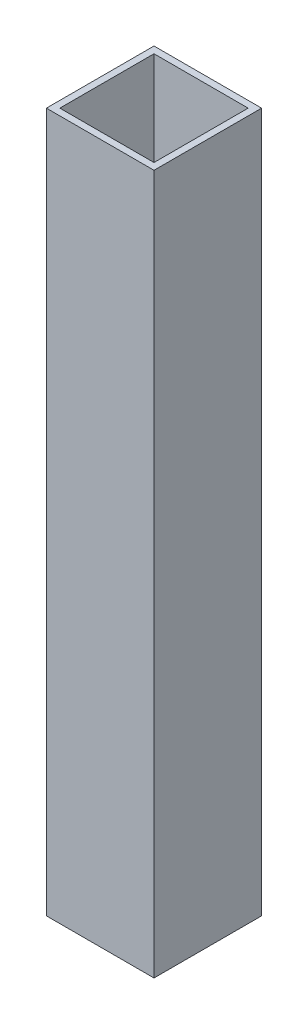
ISO-10303-21;
HEADER;
FILE_DESCRIPTION(('STEP AP214'),'2;1');
FILE_NAME('part.step','',(''),(''),'','','');
FILE_SCHEMA(('AUTOMOTIVE_DESIGN { 1 0 10303 214 1 1 1 1 }'));
ENDSEC;
DATA;
#1=APPLICATION_CONTEXT('core data for automotive mechanical design processes');
#2=APPLICATION_PROTOCOL_DEFINITION('international standard','automotive_design',2000,#1);
#3=PRODUCT_CONTEXT('',#1,'mechanical');
#4=PRODUCT('Part','Part','',(#3));
#5=PRODUCT_RELATED_PRODUCT_CATEGORY('part','',(#4));
#6=PRODUCT_DEFINITION_FORMATION('','',#4);
#7=PRODUCT_DEFINITION_CONTEXT('part definition',#1,'design');
#8=PRODUCT_DEFINITION('design','',#6,#7);
#9=PRODUCT_DEFINITION_SHAPE('','',#8);
#10=(LENGTH_UNIT() NAMED_UNIT(*) SI_UNIT(.MILLI.,.METRE.));
#11=(NAMED_UNIT(*) PLANE_ANGLE_UNIT() SI_UNIT($,.RADIAN.));
#12=(NAMED_UNIT(*) SI_UNIT($,.STERADIAN.) SOLID_ANGLE_UNIT());
#13=UNCERTAINTY_MEASURE_WITH_UNIT(LENGTH_MEASURE(1.E-05),#10,'distance_accuracy_value','');
#14=(GEOMETRIC_REPRESENTATION_CONTEXT(3) GLOBAL_UNCERTAINTY_ASSIGNED_CONTEXT((#13)) GLOBAL_UNIT_ASSIGNED_CONTEXT((#10,
#11,#12)) REPRESENTATION_CONTEXT('',''));
#15=CARTESIAN_POINT('',(0.,0.,0.));
#16=DIRECTION('',(0.,0.,1.));
#17=DIRECTION('',(1.,0.,0.));
#18=AXIS2_PLACEMENT_3D('',#15,#16,#17);
#19=CARTESIAN_POINT('',(821.935699023182,165.1,152.4));
#20=DIRECTION('',(1.,0.,0.));
#21=DIRECTION('',(0.,0.,-1.));
#22=AXIS2_PLACEMENT_3D('',#19,#20,#21);
#23=PLANE('',#22);
#24=DIRECTION('',(0.,0.,1.));
#25=VECTOR('',#24,1.);
#26=CARTESIAN_POINT('',(821.935699023182,-165.1,152.4));
#27=LINE('',#26,#25);
#28=CARTESIAN_POINT('',(821.935699023182,-165.1,130.175));
#29=VERTEX_POINT('',#28);
#30=CARTESIAN_POINT('',(821.935699023182,-165.1,174.625));
#31=VERTEX_POINT('',#30);
#32=EDGE_CURVE('E158',#29,#31,#27,.T.);
#33=ORIENTED_EDGE('',*,*,#32,.T.);
#34=DIRECTION('',(0.,-1.,0.));
#35=VECTOR('',#34,1.);
#36=CARTESIAN_POINT('',(821.935699023182,165.1,174.625));
#37=LINE('',#36,#35);
#38=CARTESIAN_POINT('',(821.935699023182,165.1,174.625));
#39=VERTEX_POINT('',#38);
#40=EDGE_CURVE('E11',#39,#31,#37,.T.);
#41=ORIENTED_EDGE('',*,*,#40,.F.);
#42=DIRECTION('',(0.,0.,1.));
#43=VECTOR('',#42,1.);
#44=CARTESIAN_POINT('',(821.935699023182,165.1,152.4));
#45=LINE('',#44,#43);
#46=CARTESIAN_POINT('',(821.935699023182,165.1,130.175));
#47=VERTEX_POINT('',#46);
#48=EDGE_CURVE('E118',#47,#39,#45,.T.);
#49=ORIENTED_EDGE('',*,*,#48,.F.);
#50=DIRECTION('',(0.,-1.,0.));
#51=VECTOR('',#50,1.);
#52=CARTESIAN_POINT('',(821.935699023182,165.1,130.175));
#53=LINE('',#52,#51);
#54=EDGE_CURVE('E41',#47,#29,#53,.T.);
#55=ORIENTED_EDGE('',*,*,#54,.T.);
#56=EDGE_LOOP('',(#33,#41,#49,#55));
#57=FACE_BOUND('',#56,.T.);
#58=ADVANCED_FACE('F16',(#57),#23,.F.);
#59=CARTESIAN_POINT('',(822.268575429916,165.1,174.625));
#60=DIRECTION('',(0.,0.,1.));
#61=DIRECTION('',(1.,0.,0.));
#62=AXIS2_PLACEMENT_3D('',#59,#60,#61);
#63=PLANE('',#62);
#64=DIRECTION('',(-1.,0.,0.));
#65=VECTOR('',#64,1.);
#66=CARTESIAN_POINT('',(822.268575429916,-165.1,174.625));
#67=LINE('',#66,#65);
#68=CARTESIAN_POINT('',(777.485699023182,-165.1,174.625));
#69=VERTEX_POINT('',#68);
#70=EDGE_CURVE('E125',#31,#69,#67,.T.);
#71=ORIENTED_EDGE('',*,*,#70,.T.);
#72=DIRECTION('',(0.,-1.,0.));
#73=VECTOR('',#72,1.);
#74=CARTESIAN_POINT('',(777.485699023182,165.1,174.625));
#75=LINE('',#74,#73);
#76=CARTESIAN_POINT('',(777.485699023182,165.1,174.625));
#77=VERTEX_POINT('',#76);
#78=EDGE_CURVE('E27',#77,#69,#75,.T.);
#79=ORIENTED_EDGE('',*,*,#78,.F.);
#80=DIRECTION('',(-1.,0.,0.));
#81=VECTOR('',#80,1.);
#82=CARTESIAN_POINT('',(822.268575429916,165.1,174.625));
#83=LINE('',#82,#81);
#84=EDGE_CURVE('E112',#39,#77,#83,.T.);
#85=ORIENTED_EDGE('',*,*,#84,.F.);
#86=ORIENTED_EDGE('',*,*,#40,.T.);
#87=EDGE_LOOP('',(#71,#79,#85,#86));
#88=FACE_BOUND('',#87,.T.);
#89=ADVANCED_FACE('F124',(#88),#63,.F.);
#90=CARTESIAN_POINT('',(777.485699023182,165.1,152.4));
#91=DIRECTION('',(1.,0.,0.));
#92=DIRECTION('',(0.,0.,-1.));
#93=AXIS2_PLACEMENT_3D('',#90,#91,#92);
#94=PLANE('',#93);
#95=DIRECTION('',(0.,0.,1.));
#96=VECTOR('',#95,1.);
#97=CARTESIAN_POINT('',(777.485699023182,-165.1,152.4));
#98=LINE('',#97,#96);
#99=CARTESIAN_POINT('',(777.485699023182,-165.1,130.175));
#100=VERTEX_POINT('',#99);
#101=EDGE_CURVE('E163',#100,#69,#98,.T.);
#102=ORIENTED_EDGE('',*,*,#101,.F.);
#103=DIRECTION('',(0.,-1.,0.));
#104=VECTOR('',#103,1.);
#105=CARTESIAN_POINT('',(777.485699023182,165.1,130.175));
#106=LINE('',#105,#104);
#107=CARTESIAN_POINT('',(777.485699023182,165.1,130.175));
#108=VERTEX_POINT('',#107);
#109=EDGE_CURVE('E76',#108,#100,#106,.T.);
#110=ORIENTED_EDGE('',*,*,#109,.F.);
#111=DIRECTION('',(0.,0.,1.));
#112=VECTOR('',#111,1.);
#113=CARTESIAN_POINT('',(777.485699023182,165.1,152.4));
#114=LINE('',#113,#112);
#115=EDGE_CURVE('E117',#108,#77,#114,.T.);
#116=ORIENTED_EDGE('',*,*,#115,.T.);
#117=ORIENTED_EDGE('',*,*,#78,.T.);
#118=EDGE_LOOP('',(#102,#110,#116,#117));
#119=FACE_BOUND('',#118,.T.);
#120=ADVANCED_FACE('F130',(#119),#94,.T.);
#121=CARTESIAN_POINT('',(661.181740408425,165.1,127.));
#122=DIRECTION('',(0.,0.,-1.));
#123=DIRECTION('',(-1.,0.,0.));
#124=AXIS2_PLACEMENT_3D('',#121,#122,#123);
#125=PLANE('',#124);
#126=DIRECTION('',(1.,0.,0.));
#127=VECTOR('',#126,1.);
#128=CARTESIAN_POINT('',(661.181740408425,-165.1,127.));
#129=LINE('',#128,#127);
#130=CARTESIAN_POINT('',(774.310699023182,-165.1,127.));
#131=VERTEX_POINT('',#130);
#132=CARTESIAN_POINT('',(825.110699023182,-165.1,127.));
#133=VERTEX_POINT('',#132);
#134=EDGE_CURVE('E142',#131,#133,#129,.T.);
#135=ORIENTED_EDGE('',*,*,#134,.F.);
#136=DIRECTION('',(0.,-1.,0.));
#137=VECTOR('',#136,1.);
#138=CARTESIAN_POINT('',(774.310699023182,165.1,127.));
#139=LINE('',#138,#137);
#140=CARTESIAN_POINT('',(774.310699023182,165.1,127.));
#141=VERTEX_POINT('',#140);
#142=EDGE_CURVE('E20',#141,#131,#139,.T.);
#143=ORIENTED_EDGE('',*,*,#142,.F.);
#144=DIRECTION('',(1.,0.,0.));
#145=VECTOR('',#144,1.);
#146=CARTESIAN_POINT('',(661.181740408425,165.1,127.));
#147=LINE('',#146,#145);
#148=CARTESIAN_POINT('',(825.110699023182,165.1,127.));
#149=VERTEX_POINT('',#148);
#150=EDGE_CURVE('E170',#141,#149,#147,.T.);
#151=ORIENTED_EDGE('',*,*,#150,.T.);
#152=DIRECTION('',(0.,-1.,0.));
#153=VECTOR('',#152,1.);
#154=CARTESIAN_POINT('',(825.110699023182,165.1,127.));
#155=LINE('',#154,#153);
#156=EDGE_CURVE('E138',#149,#133,#155,.T.);
#157=ORIENTED_EDGE('',*,*,#156,.T.);
#158=EDGE_LOOP('',(#135,#143,#151,#157));
#159=FACE_BOUND('',#158,.T.);
#160=ADVANCED_FACE('F18',(#159),#125,.T.);
#161=CARTESIAN_POINT('',(774.310699023182,165.1,152.4));
#162=DIRECTION('',(1.,0.,0.));
#163=DIRECTION('',(0.,0.,-1.));
#164=AXIS2_PLACEMENT_3D('',#161,#162,#163);
#165=PLANE('',#164);
#166=DIRECTION('',(0.,0.,1.));
#167=VECTOR('',#166,1.);
#168=CARTESIAN_POINT('',(774.310699023182,-165.1,152.4));
#169=LINE('',#168,#167);
#170=CARTESIAN_POINT('',(774.310699023182,-165.1,177.8));
#171=VERTEX_POINT('',#170);
#172=EDGE_CURVE('E146',#131,#171,#169,.T.);
#173=ORIENTED_EDGE('',*,*,#172,.T.);
#174=DIRECTION('',(0.,-1.,0.));
#175=VECTOR('',#174,1.);
#176=CARTESIAN_POINT('',(774.310699023182,165.1,177.8));
#177=LINE('',#176,#175);
#178=CARTESIAN_POINT('',(774.310699023182,165.1,177.8));
#179=VERTEX_POINT('',#178);
#180=EDGE_CURVE('E179',#179,#171,#177,.T.);
#181=ORIENTED_EDGE('',*,*,#180,.F.);
#182=DIRECTION('',(0.,0.,1.));
#183=VECTOR('',#182,1.);
#184=CARTESIAN_POINT('',(774.310699023182,165.1,152.4));
#185=LINE('',#184,#183);
#186=EDGE_CURVE('E191',#141,#179,#185,.T.);
#187=ORIENTED_EDGE('',*,*,#186,.F.);
#188=ORIENTED_EDGE('',*,*,#142,.T.);
#189=EDGE_LOOP('',(#173,#181,#187,#188));
#190=FACE_BOUND('',#189,.T.);
#191=ADVANCED_FACE('F190',(#190),#165,.F.);
#192=CARTESIAN_POINT('',(686.616627278044,165.1,177.8));
#193=DIRECTION('',(0.,0.,1.));
#194=DIRECTION('',(1.,0.,0.));
#195=AXIS2_PLACEMENT_3D('',#192,#193,#194);
#196=PLANE('',#195);
#197=DIRECTION('',(-1.,0.,0.));
#198=VECTOR('',#197,1.);
#199=CARTESIAN_POINT('',(686.616627278044,-165.1,177.8));
#200=LINE('',#199,#198);
#201=CARTESIAN_POINT('',(825.110699023182,-165.1,177.8));
#202=VERTEX_POINT('',#201);
#203=EDGE_CURVE('E150',#202,#171,#200,.T.);
#204=ORIENTED_EDGE('',*,*,#203,.F.);
#205=DIRECTION('',(0.,-1.,0.));
#206=VECTOR('',#205,1.);
#207=CARTESIAN_POINT('',(825.110699023182,165.1,177.8));
#208=LINE('',#207,#206);
#209=CARTESIAN_POINT('',(825.110699023182,165.1,177.8));
#210=VERTEX_POINT('',#209);
#211=EDGE_CURVE('E177',#210,#202,#208,.T.);
#212=ORIENTED_EDGE('',*,*,#211,.F.);
#213=DIRECTION('',(-1.,0.,0.));
#214=VECTOR('',#213,1.);
#215=CARTESIAN_POINT('',(686.616627278044,165.1,177.8));
#216=LINE('',#215,#214);
#217=EDGE_CURVE('E234',#210,#179,#216,.T.);
#218=ORIENTED_EDGE('',*,*,#217,.T.);
#219=ORIENTED_EDGE('',*,*,#180,.T.);
#220=EDGE_LOOP('',(#204,#212,#218,#219));
#221=FACE_BOUND('',#220,.T.);
#222=ADVANCED_FACE('F203',(#221),#196,.T.);
#223=CARTESIAN_POINT('',(825.110699023182,165.1,152.4));
#224=DIRECTION('',(1.,0.,0.));
#225=DIRECTION('',(0.,0.,-1.));
#226=AXIS2_PLACEMENT_3D('',#223,#224,#225);
#227=PLANE('',#226);
#228=DIRECTION('',(0.,0.,1.));
#229=VECTOR('',#228,1.);
#230=CARTESIAN_POINT('',(825.110699023182,-165.1,152.4));
#231=LINE('',#230,#229);
#232=EDGE_CURVE('E154',#133,#202,#231,.T.);
#233=ORIENTED_EDGE('',*,*,#232,.F.);
#234=ORIENTED_EDGE('',*,*,#156,.F.);
#235=DIRECTION('',(0.,0.,1.));
#236=VECTOR('',#235,1.);
#237=CARTESIAN_POINT('',(825.110699023182,165.1,152.4));
#238=LINE('',#237,#236);
#239=EDGE_CURVE('E201',#149,#210,#238,.T.);
#240=ORIENTED_EDGE('',*,*,#239,.T.);
#241=ORIENTED_EDGE('',*,*,#211,.T.);
#242=EDGE_LOOP('',(#233,#234,#240,#241));
#243=FACE_BOUND('',#242,.T.);
#244=ADVANCED_FACE('F200',(#243),#227,.T.);
#245=CARTESIAN_POINT('',(822.268575429916,165.1,130.175));
#246=DIRECTION('',(0.,0.,1.));
#247=DIRECTION('',(1.,0.,0.));
#248=AXIS2_PLACEMENT_3D('',#245,#246,#247);
#249=PLANE('',#248);
#250=DIRECTION('',(-1.,0.,0.));
#251=VECTOR('',#250,1.);
#252=CARTESIAN_POINT('',(822.268575429916,-165.1,130.175));
#253=LINE('',#252,#251);
#254=EDGE_CURVE('E166',#29,#100,#253,.T.);
#255=ORIENTED_EDGE('',*,*,#254,.F.);
#256=ORIENTED_EDGE('',*,*,#54,.F.);
#257=DIRECTION('',(-1.,0.,0.));
#258=VECTOR('',#257,1.);
#259=CARTESIAN_POINT('',(822.268575429916,165.1,130.175));
#260=LINE('',#259,#258);
#261=EDGE_CURVE('E132',#47,#108,#260,.T.);
#262=ORIENTED_EDGE('',*,*,#261,.T.);
#263=ORIENTED_EDGE('',*,*,#109,.T.);
#264=EDGE_LOOP('',(#255,#256,#262,#263));
#265=FACE_BOUND('',#264,.T.);
#266=ADVANCED_FACE('F210',(#265),#249,.T.);
#267=CARTESIAN_POINT('',(801.885855165659,165.1,152.4));
#268=DIRECTION('',(0.,1.,0.));
#269=DIRECTION('',(-1.,0.,0.));
#270=AXIS2_PLACEMENT_3D('',#267,#268,#269);
#271=PLANE('',#270);
#272=ORIENTED_EDGE('',*,*,#150,.F.);
#273=ORIENTED_EDGE('',*,*,#186,.T.);
#274=ORIENTED_EDGE('',*,*,#217,.F.);
#275=ORIENTED_EDGE('',*,*,#239,.F.);
#276=EDGE_LOOP('',(#272,#273,#274,#275));
#277=FACE_BOUND('',#276,.T.);
#278=ORIENTED_EDGE('',*,*,#48,.T.);
#279=ORIENTED_EDGE('',*,*,#84,.T.);
#280=ORIENTED_EDGE('',*,*,#115,.F.);
#281=ORIENTED_EDGE('',*,*,#261,.F.);
#282=EDGE_LOOP('',(#278,#279,#280,#281));
#283=FACE_BOUND('',#282,.T.);
#284=ADVANCED_FACE('F114',(#277,#283),#271,.T.);
#285=CARTESIAN_POINT('',(801.885855165659,-165.1,152.4));
#286=DIRECTION('',(0.,1.,0.));
#287=DIRECTION('',(-1.,0.,0.));
#288=AXIS2_PLACEMENT_3D('',#285,#286,#287);
#289=PLANE('',#288);
#290=ORIENTED_EDGE('',*,*,#134,.T.);
#291=ORIENTED_EDGE('',*,*,#232,.T.);
#292=ORIENTED_EDGE('',*,*,#203,.T.);
#293=ORIENTED_EDGE('',*,*,#172,.F.);
#294=EDGE_LOOP('',(#290,#291,#292,#293));
#295=FACE_BOUND('',#294,.T.);
#296=ORIENTED_EDGE('',*,*,#32,.F.);
#297=ORIENTED_EDGE('',*,*,#254,.T.);
#298=ORIENTED_EDGE('',*,*,#101,.T.);
#299=ORIENTED_EDGE('',*,*,#70,.F.);
#300=EDGE_LOOP('',(#296,#297,#298,#299));
#301=FACE_BOUND('',#300,.T.);
#302=ADVANCED_FACE('F194',(#295,#301),#289,.F.);
#303=CLOSED_SHELL('',(#58,#89,#120,#160,#191,#222,#244,#266,#284,#302));
#304=MANIFOLD_SOLID_BREP('B1',#303);
#305=ADVANCED_BREP_SHAPE_REPRESENTATION('',(#18,#304),#14);
#306=SHAPE_DEFINITION_REPRESENTATION(#9,#305);
ENDSEC;
END-ISO-10303-21;
